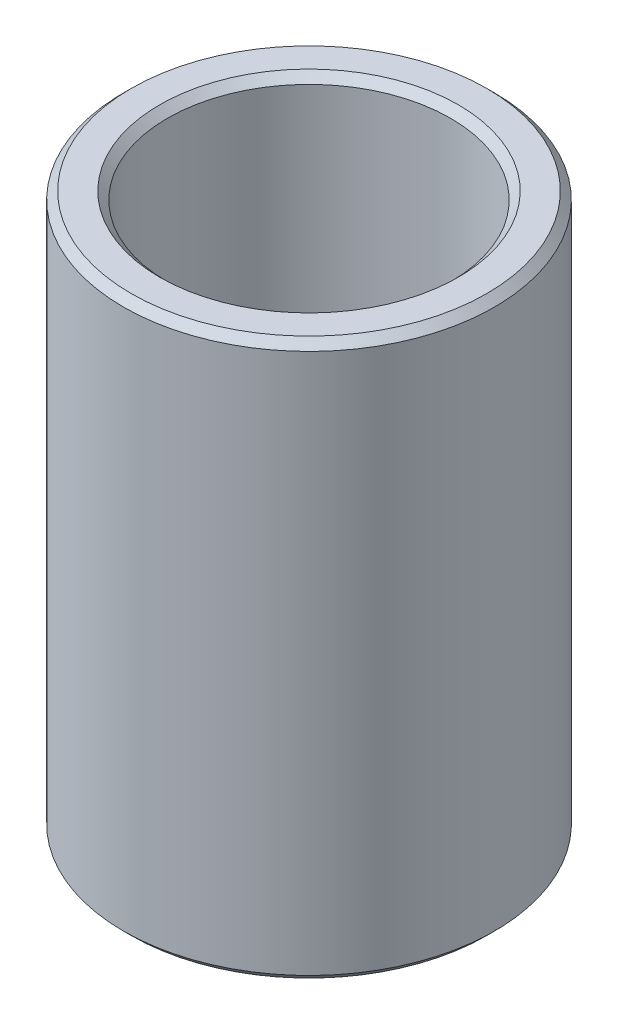
ISO-10303-21;
HEADER;
FILE_DESCRIPTION(('STEP AP214'),'2;1');
FILE_NAME('part.step','',(''),(''),'','','');
FILE_SCHEMA(('AUTOMOTIVE_DESIGN { 1 0 10303 214 1 1 1 1 }'));
ENDSEC;
DATA;
#1=APPLICATION_CONTEXT('core data for automotive mechanical design processes');
#2=APPLICATION_PROTOCOL_DEFINITION('international standard','automotive_design',2000,#1);
#3=PRODUCT_CONTEXT('',#1,'mechanical');
#4=PRODUCT('Part','Part','',(#3));
#5=PRODUCT_RELATED_PRODUCT_CATEGORY('part','',(#4));
#6=PRODUCT_DEFINITION_FORMATION('','',#4);
#7=PRODUCT_DEFINITION_CONTEXT('part definition',#1,'design');
#8=PRODUCT_DEFINITION('design','',#6,#7);
#9=PRODUCT_DEFINITION_SHAPE('','',#8);
#10=(LENGTH_UNIT() NAMED_UNIT(*) SI_UNIT(.MILLI.,.METRE.));
#11=(NAMED_UNIT(*) PLANE_ANGLE_UNIT() SI_UNIT($,.RADIAN.));
#12=(NAMED_UNIT(*) SI_UNIT($,.STERADIAN.) SOLID_ANGLE_UNIT());
#13=UNCERTAINTY_MEASURE_WITH_UNIT(LENGTH_MEASURE(1.E-05),#10,'distance_accuracy_value','');
#14=(GEOMETRIC_REPRESENTATION_CONTEXT(3) GLOBAL_UNCERTAINTY_ASSIGNED_CONTEXT((#13)) GLOBAL_UNIT_ASSIGNED_CONTEXT((#10,
#11,#12)) REPRESENTATION_CONTEXT('',''));
#15=CARTESIAN_POINT('',(0.,0.,0.));
#16=DIRECTION('',(0.,0.,1.));
#17=DIRECTION('',(1.,0.,0.));
#18=AXIS2_PLACEMENT_3D('',#15,#16,#17);
#19=CARTESIAN_POINT('',(0.,119.880863887912,0.));
#20=DIRECTION('',(0.,-1.,0.));
#21=DIRECTION('',(0.,0.,-1.));
#22=AXIS2_PLACEMENT_3D('',#19,#20,#21);
#23=CYLINDRICAL_SURFACE('',#22,40.);
#24=CARTESIAN_POINT('',(0.,1.67608284921471,0.));
#25=DIRECTION('',(0.,1.,0.));
#26=DIRECTION('',(0.,0.,1.));
#27=AXIS2_PLACEMENT_3D('',#24,#25,#26);
#28=CIRCLE('',#27,40.);
#29=CARTESIAN_POINT('',(0.,1.67608284921471,40.));
#30=VERTEX_POINT('',#29);
#31=EDGE_CURVE('E10',#30,#30,#28,.T.);
#32=ORIENTED_EDGE('',*,*,#31,.T.);
#33=EDGE_LOOP('',(#32));
#34=FACE_BOUND('',#33,.T.);
#35=CARTESIAN_POINT('',(0.,118.204781038697,0.));
#36=DIRECTION('',(0.,1.,0.));
#37=DIRECTION('',(0.,0.,1.));
#38=AXIS2_PLACEMENT_3D('',#35,#36,#37);
#39=CIRCLE('',#38,40.);
#40=CARTESIAN_POINT('',(0.,118.204781038697,40.));
#41=VERTEX_POINT('',#40);
#42=EDGE_CURVE('E50',#41,#41,#39,.F.);
#43=ORIENTED_EDGE('',*,*,#42,.T.);
#44=EDGE_LOOP('',(#43));
#45=FACE_BOUND('',#44,.T.);
#46=ADVANCED_FACE('F39',(#34,#45),#23,.T.);
#47=CARTESIAN_POINT('',(0.,119.880863887912,0.));
#48=DIRECTION('',(0.,1.,0.));
#49=DIRECTION('',(0.,0.,1.));
#50=AXIS2_PLACEMENT_3D('',#47,#48,#49);
#51=PLANE('',#50);
#52=CARTESIAN_POINT('',(0.,119.880863887912,0.));
#53=DIRECTION('',(0.,1.,0.));
#54=DIRECTION('',(0.,0.,1.));
#55=AXIS2_PLACEMENT_3D('',#52,#53,#54);
#56=CIRCLE('',#55,32.2051730328402);
#57=CARTESIAN_POINT('',(0.,119.880863887912,32.2051730328402));
#58=VERTEX_POINT('',#57);
#59=EDGE_CURVE('E58',#58,#58,#56,.F.);
#60=ORIENTED_EDGE('',*,*,#59,.T.);
#61=EDGE_LOOP('',(#60));
#62=FACE_BOUND('',#61,.T.);
#63=CARTESIAN_POINT('',(0.,119.880863887912,0.));
#64=DIRECTION('',(0.,1.,0.));
#65=DIRECTION('',(0.,0.,1.));
#66=AXIS2_PLACEMENT_3D('',#63,#64,#65);
#67=CIRCLE('',#66,38.3239171507853);
#68=CARTESIAN_POINT('',(0.,119.880863887912,38.3239171507853));
#69=VERTEX_POINT('',#68);
#70=EDGE_CURVE('E61',#69,#69,#67,.T.);
#71=ORIENTED_EDGE('',*,*,#70,.T.);
#72=EDGE_LOOP('',(#71));
#73=FACE_BOUND('',#72,.T.);
#74=ADVANCED_FACE('F88',(#62,#73),#51,.T.);
#75=CARTESIAN_POINT('',(0.,0.,0.));
#76=DIRECTION('',(0.,1.,0.));
#77=DIRECTION('',(0.,0.,1.));
#78=AXIS2_PLACEMENT_3D('',#75,#76,#77);
#79=PLANE('',#78);
#80=CARTESIAN_POINT('',(0.,0.,0.));
#81=DIRECTION('',(0.,1.,0.));
#82=DIRECTION('',(0.,0.,1.));
#83=AXIS2_PLACEMENT_3D('',#80,#81,#82);
#84=CIRCLE('',#83,32.2051730328402);
#85=CARTESIAN_POINT('',(0.,0.,32.2051730328402));
#86=VERTEX_POINT('',#85);
#87=EDGE_CURVE('E51',#86,#86,#84,.T.);
#88=ORIENTED_EDGE('',*,*,#87,.T.);
#89=EDGE_LOOP('',(#88));
#90=FACE_BOUND('',#89,.T.);
#91=CARTESIAN_POINT('',(0.,0.,0.));
#92=DIRECTION('',(0.,1.,0.));
#93=DIRECTION('',(0.,0.,1.));
#94=AXIS2_PLACEMENT_3D('',#91,#92,#93);
#95=CIRCLE('',#94,38.3239171507853);
#96=CARTESIAN_POINT('',(0.,0.,38.3239171507853));
#97=VERTEX_POINT('',#96);
#98=EDGE_CURVE('E54',#97,#97,#95,.F.);
#99=ORIENTED_EDGE('',*,*,#98,.T.);
#100=EDGE_LOOP('',(#99));
#101=FACE_BOUND('',#100,.T.);
#102=ADVANCED_FACE('F83',(#90,#101),#79,.F.);
#103=CARTESIAN_POINT('',(0.,119.880863887912,0.));
#104=DIRECTION('',(0.,-1.,0.));
#105=DIRECTION('',(0.,0.,-1.));
#106=AXIS2_PLACEMENT_3D('',#103,#104,#105);
#107=CYLINDRICAL_SURFACE('',#106,30.5290901836255);
#108=CARTESIAN_POINT('',(0.,118.204781038697,0.));
#109=DIRECTION('',(0.,1.,0.));
#110=DIRECTION('',(0.,0.,1.));
#111=AXIS2_PLACEMENT_3D('',#108,#109,#110);
#112=CIRCLE('',#111,30.5290901836255);
#113=CARTESIAN_POINT('',(0.,118.204781038697,30.5290901836255));
#114=VERTEX_POINT('',#113);
#115=EDGE_CURVE('E67',#114,#114,#112,.T.);
#116=ORIENTED_EDGE('',*,*,#115,.T.);
#117=EDGE_LOOP('',(#116));
#118=FACE_BOUND('',#117,.T.);
#119=CARTESIAN_POINT('',(0.,1.67608284921472,0.));
#120=DIRECTION('',(0.,1.,0.));
#121=DIRECTION('',(0.,0.,1.));
#122=AXIS2_PLACEMENT_3D('',#119,#120,#121);
#123=CIRCLE('',#122,30.5290901836255);
#124=CARTESIAN_POINT('',(0.,1.67608284921472,30.5290901836255));
#125=VERTEX_POINT('',#124);
#126=EDGE_CURVE('E69',#125,#125,#123,.F.);
#127=ORIENTED_EDGE('',*,*,#126,.T.);
#128=EDGE_LOOP('',(#127));
#129=FACE_BOUND('',#128,.T.);
#130=ADVANCED_FACE('F71',(#118,#129),#107,.F.);
#131=CARTESIAN_POINT('',(0.,118.204781038697,0.));
#132=DIRECTION('',(0.,1.,0.));
#133=DIRECTION('',(0.,0.,1.));
#134=AXIS2_PLACEMENT_3D('',#131,#132,#133);
#135=CONICAL_SURFACE('',#134,30.5290901836255,0.785398163397446);
#136=ORIENTED_EDGE('',*,*,#59,.F.);
#137=EDGE_LOOP('',(#136));
#138=FACE_BOUND('',#137,.T.);
#139=ORIENTED_EDGE('',*,*,#115,.F.);
#140=EDGE_LOOP('',(#139));
#141=FACE_BOUND('',#140,.T.);
#142=ADVANCED_FACE('F77',(#138,#141),#135,.F.);
#143=CARTESIAN_POINT('',(0.,0.,0.));
#144=DIRECTION('',(0.,-1.,0.));
#145=DIRECTION('',(0.,0.,-1.));
#146=AXIS2_PLACEMENT_3D('',#143,#144,#145);
#147=CONICAL_SURFACE('',#146,32.2051730328402,0.785398163397442);
#148=ORIENTED_EDGE('',*,*,#126,.F.);
#149=EDGE_LOOP('',(#148));
#150=FACE_BOUND('',#149,.T.);
#151=ORIENTED_EDGE('',*,*,#87,.F.);
#152=EDGE_LOOP('',(#151));
#153=FACE_BOUND('',#152,.T.);
#154=ADVANCED_FACE('F73',(#150,#153),#147,.F.);
#155=CARTESIAN_POINT('',(0.,1.67608284921471,0.));
#156=DIRECTION('',(0.,1.,0.));
#157=DIRECTION('',(0.,0.,1.));
#158=AXIS2_PLACEMENT_3D('',#155,#156,#157);
#159=CONICAL_SURFACE('',#158,40.,0.78539816339745);
#160=ORIENTED_EDGE('',*,*,#98,.F.);
#161=EDGE_LOOP('',(#160));
#162=FACE_BOUND('',#161,.T.);
#163=ORIENTED_EDGE('',*,*,#31,.F.);
#164=EDGE_LOOP('',(#163));
#165=FACE_BOUND('',#164,.T.);
#166=ADVANCED_FACE('F76',(#162,#165),#159,.T.);
#167=CARTESIAN_POINT('',(0.,119.880863887912,0.));
#168=DIRECTION('',(0.,-1.,0.));
#169=DIRECTION('',(0.,0.,-1.));
#170=AXIS2_PLACEMENT_3D('',#167,#168,#169);
#171=CONICAL_SURFACE('',#170,38.3239171507853,0.785398163397438);
#172=ORIENTED_EDGE('',*,*,#42,.F.);
#173=EDGE_LOOP('',(#172));
#174=FACE_BOUND('',#173,.T.);
#175=ORIENTED_EDGE('',*,*,#70,.F.);
#176=EDGE_LOOP('',(#175));
#177=FACE_BOUND('',#176,.T.);
#178=ADVANCED_FACE('F45',(#174,#177),#171,.T.);
#179=CLOSED_SHELL('',(#46,#74,#102,#130,#142,#154,#166,#178));
#180=MANIFOLD_SOLID_BREP('B2',#179);
#181=ADVANCED_BREP_SHAPE_REPRESENTATION('',(#18,#180),#14);
#182=SHAPE_DEFINITION_REPRESENTATION(#9,#181);
ENDSEC;
END-ISO-10303-21;
